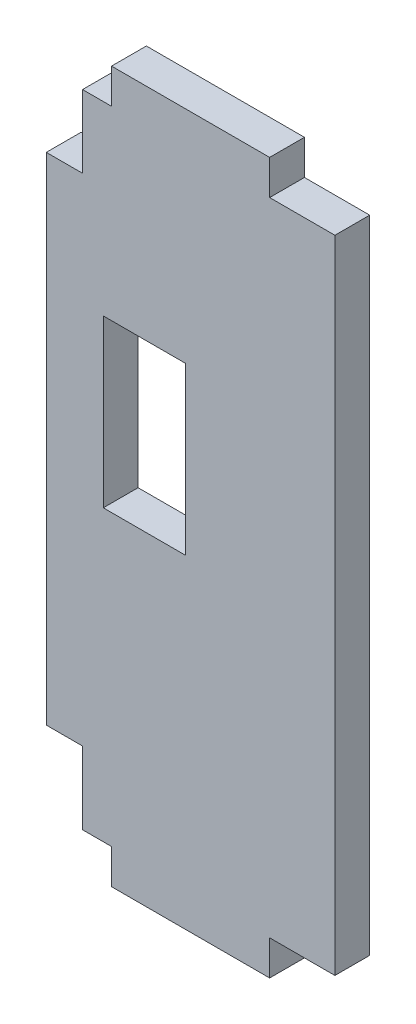
ISO-10303-21;
HEADER;
FILE_DESCRIPTION(('STEP AP214'),'2;1');
FILE_NAME('part.step','',(''),(''),'','','');
FILE_SCHEMA(('AUTOMOTIVE_DESIGN { 1 0 10303 214 1 1 1 1 }'));
ENDSEC;
DATA;
#1=APPLICATION_CONTEXT('core data for automotive mechanical design processes');
#2=APPLICATION_PROTOCOL_DEFINITION('international standard','automotive_design',2000,#1);
#3=PRODUCT_CONTEXT('',#1,'mechanical');
#4=PRODUCT('Part','Part','',(#3));
#5=PRODUCT_RELATED_PRODUCT_CATEGORY('part','',(#4));
#6=PRODUCT_DEFINITION_FORMATION('','',#4);
#7=PRODUCT_DEFINITION_CONTEXT('part definition',#1,'design');
#8=PRODUCT_DEFINITION('design','',#6,#7);
#9=PRODUCT_DEFINITION_SHAPE('','',#8);
#10=(LENGTH_UNIT() NAMED_UNIT(*) SI_UNIT(.MILLI.,.METRE.));
#11=(NAMED_UNIT(*) PLANE_ANGLE_UNIT() SI_UNIT($,.RADIAN.));
#12=(NAMED_UNIT(*) SI_UNIT($,.STERADIAN.) SOLID_ANGLE_UNIT());
#13=UNCERTAINTY_MEASURE_WITH_UNIT(LENGTH_MEASURE(1.E-05),#10,'distance_accuracy_value','');
#14=(GEOMETRIC_REPRESENTATION_CONTEXT(3) GLOBAL_UNCERTAINTY_ASSIGNED_CONTEXT((#13)) GLOBAL_UNIT_ASSIGNED_CONTEXT((#10,
#11,#12)) REPRESENTATION_CONTEXT('',''));
#15=CARTESIAN_POINT('',(0.,0.,0.));
#16=DIRECTION('',(0.,0.,1.));
#17=DIRECTION('',(1.,0.,0.));
#18=AXIS2_PLACEMENT_3D('',#15,#16,#17);
#19=CARTESIAN_POINT('',(0.,0.,3.048));
#20=DIRECTION('',(0.,0.,1.));
#21=DIRECTION('',(1.,0.,0.));
#22=AXIS2_PLACEMENT_3D('',#19,#20,#21);
#23=PLANE('',#22);
#24=DIRECTION('',(-1.,0.,0.));
#25=VECTOR('',#24,1.);
#26=CARTESIAN_POINT('',(-17.3482,-0.558799999999996,3.048));
#27=LINE('',#26,#25);
#28=CARTESIAN_POINT('',(-14.8082,-0.558799999999996,3.048));
#29=VERTEX_POINT('',#28);
#30=CARTESIAN_POINT('',(-17.3482,-0.558799999999996,3.048));
#31=VERTEX_POINT('',#30);
#32=EDGE_CURVE('E206',#29,#31,#27,.T.);
#33=ORIENTED_EDGE('',*,*,#32,.T.);
#34=DIRECTION('',(0.,-1.,0.));
#35=VECTOR('',#34,1.);
#36=CARTESIAN_POINT('',(-17.3482,-0.558799999999996,3.048));
#37=LINE('',#36,#35);
#38=CARTESIAN_POINT('',(-17.3482,-6.9088,3.048));
#39=VERTEX_POINT('',#38);
#40=EDGE_CURVE('E209',#31,#39,#37,.T.);
#41=ORIENTED_EDGE('',*,*,#40,.T.);
#42=DIRECTION('',(-1.,0.,0.));
#43=VECTOR('',#42,1.);
#44=CARTESIAN_POINT('',(-17.3482,-6.9088,3.048));
#45=LINE('',#44,#43);
#46=CARTESIAN_POINT('',(-20.5232,-6.9088,3.048));
#47=VERTEX_POINT('',#46);
#48=EDGE_CURVE('E212',#39,#47,#45,.T.);
#49=ORIENTED_EDGE('',*,*,#48,.T.);
#50=DIRECTION('',(0.,-1.,0.));
#51=VECTOR('',#50,1.);
#52=CARTESIAN_POINT('',(-20.5232,-6.9088,3.048));
#53=LINE('',#52,#51);
#54=CARTESIAN_POINT('',(-20.5232,-50.3428,3.048));
#55=VERTEX_POINT('',#54);
#56=EDGE_CURVE('E214',#47,#55,#53,.T.);
#57=ORIENTED_EDGE('',*,*,#56,.T.);
#58=DIRECTION('',(1.,0.,0.));
#59=VECTOR('',#58,1.);
#60=CARTESIAN_POINT('',(-20.5232,-50.3428,3.048));
#61=LINE('',#60,#59);
#62=CARTESIAN_POINT('',(-17.3482,-50.3428,3.048));
#63=VERTEX_POINT('',#62);
#64=EDGE_CURVE('E216',#55,#63,#61,.T.);
#65=ORIENTED_EDGE('',*,*,#64,.T.);
#66=DIRECTION('',(0.,-1.,0.));
#67=VECTOR('',#66,1.);
#68=CARTESIAN_POINT('',(-17.3482,-50.3428,3.048));
#69=LINE('',#68,#67);
#70=CARTESIAN_POINT('',(-17.3482,-56.6928,3.048));
#71=VERTEX_POINT('',#70);
#72=EDGE_CURVE('E218',#63,#71,#69,.T.);
#73=ORIENTED_EDGE('',*,*,#72,.T.);
#74=DIRECTION('',(1.,0.,0.));
#75=VECTOR('',#74,1.);
#76=CARTESIAN_POINT('',(-14.8082,-56.6928,3.048));
#77=LINE('',#76,#75);
#78=CARTESIAN_POINT('',(-14.8082,-56.6928,3.048));
#79=VERTEX_POINT('',#78);
#80=EDGE_CURVE('E220',#71,#79,#77,.T.);
#81=ORIENTED_EDGE('',*,*,#80,.T.);
#82=DIRECTION('',(0.,-1.,0.));
#83=VECTOR('',#82,1.);
#84=CARTESIAN_POINT('',(-14.8082,-59.7408,3.048));
#85=LINE('',#84,#83);
#86=CARTESIAN_POINT('',(-14.8082,-59.7408,3.048));
#87=VERTEX_POINT('',#86);
#88=EDGE_CURVE('E222',#79,#87,#85,.T.);
#89=ORIENTED_EDGE('',*,*,#88,.T.);
#90=DIRECTION('',(1.,0.,0.));
#91=VECTOR('',#90,1.);
#92=CARTESIAN_POINT('',(-0.965199999999926,-59.7408,3.048));
#93=LINE('',#92,#91);
#94=CARTESIAN_POINT('',(-0.965199999999926,-59.7408,3.048));
#95=VERTEX_POINT('',#94);
#96=EDGE_CURVE('E224',#87,#95,#93,.T.);
#97=ORIENTED_EDGE('',*,*,#96,.T.);
#98=DIRECTION('',(0.,1.,0.));
#99=VECTOR('',#98,1.);
#100=CARTESIAN_POINT('',(-0.965199999999925,-56.6928,3.048));
#101=LINE('',#100,#99);
#102=CARTESIAN_POINT('',(-0.965199999999925,-56.6928,3.048));
#103=VERTEX_POINT('',#102);
#104=EDGE_CURVE('E226',#95,#103,#101,.T.);
#105=ORIENTED_EDGE('',*,*,#104,.T.);
#106=DIRECTION('',(1.,0.,0.));
#107=VECTOR('',#106,1.);
#108=CARTESIAN_POINT('',(4.74980000000007,-56.6928,3.048));
#109=LINE('',#108,#107);
#110=CARTESIAN_POINT('',(4.74980000000007,-56.6928,3.048));
#111=VERTEX_POINT('',#110);
#112=EDGE_CURVE('E228',#103,#111,#109,.T.);
#113=ORIENTED_EDGE('',*,*,#112,.T.);
#114=DIRECTION('',(0.,1.,0.));
#115=VECTOR('',#114,1.);
#116=CARTESIAN_POINT('',(4.74980000000007,-0.558800000000003,3.048));
#117=LINE('',#116,#115);
#118=CARTESIAN_POINT('',(4.74980000000007,-0.558800000000003,3.048));
#119=VERTEX_POINT('',#118);
#120=EDGE_CURVE('E230',#111,#119,#117,.T.);
#121=ORIENTED_EDGE('',*,*,#120,.T.);
#122=DIRECTION('',(-1.,0.,0.));
#123=VECTOR('',#122,1.);
#124=CARTESIAN_POINT('',(-0.965199999999925,-0.558800000000003,3.048));
#125=LINE('',#124,#123);
#126=CARTESIAN_POINT('',(-0.965199999999925,-0.558800000000003,3.048));
#127=VERTEX_POINT('',#126);
#128=EDGE_CURVE('E232',#119,#127,#125,.T.);
#129=ORIENTED_EDGE('',*,*,#128,.T.);
#130=DIRECTION('',(0.,1.,0.));
#131=VECTOR('',#130,1.);
#132=CARTESIAN_POINT('',(-0.965199999999925,2.4892,3.048));
#133=LINE('',#132,#131);
#134=CARTESIAN_POINT('',(-0.965199999999925,2.4892,3.048));
#135=VERTEX_POINT('',#134);
#136=EDGE_CURVE('E234',#127,#135,#133,.T.);
#137=ORIENTED_EDGE('',*,*,#136,.T.);
#138=DIRECTION('',(-1.,0.,0.));
#139=VECTOR('',#138,1.);
#140=CARTESIAN_POINT('',(-14.8082,2.4892,3.048));
#141=LINE('',#140,#139);
#142=CARTESIAN_POINT('',(-14.8082,2.4892,3.048));
#143=VERTEX_POINT('',#142);
#144=EDGE_CURVE('E236',#135,#143,#141,.T.);
#145=ORIENTED_EDGE('',*,*,#144,.T.);
#146=DIRECTION('',(0.,-1.,0.));
#147=VECTOR('',#146,1.);
#148=CARTESIAN_POINT('',(-14.8082,-0.558799999999996,3.048));
#149=LINE('',#148,#147);
#150=EDGE_CURVE('E238',#143,#29,#149,.T.);
#151=ORIENTED_EDGE('',*,*,#150,.T.);
#152=EDGE_LOOP('',(#33,#41,#49,#57,#65,#73,#81,#89,#97,#105,#113,#121,#129,#137,#145,#151));
#153=FACE_BOUND('',#152,.T.);
#154=DIRECTION('',(1.,0.,0.));
#155=VECTOR('',#154,1.);
#156=CARTESIAN_POINT('',(-15.5321,-31.369,3.048));
#157=LINE('',#156,#155);
#158=CARTESIAN_POINT('',(-15.5321,-31.369,3.048));
#159=VERTEX_POINT('',#158);
#160=CARTESIAN_POINT('',(-8.34390000000002,-31.369,3.048));
#161=VERTEX_POINT('',#160);
#162=EDGE_CURVE('E178',#159,#161,#157,.T.);
#163=ORIENTED_EDGE('',*,*,#162,.F.);
#164=DIRECTION('',(0.,-1.,0.));
#165=VECTOR('',#164,1.);
#166=CARTESIAN_POINT('',(-15.5321,-16.8148,3.048));
#167=LINE('',#166,#165);
#168=CARTESIAN_POINT('',(-15.5321,-16.8148,3.048));
#169=VERTEX_POINT('',#168);
#170=EDGE_CURVE('E170',#169,#159,#167,.T.);
#171=ORIENTED_EDGE('',*,*,#170,.F.);
#172=DIRECTION('',(-1.,0.,0.));
#173=VECTOR('',#172,1.);
#174=CARTESIAN_POINT('',(-15.5321,-16.8148,3.048));
#175=LINE('',#174,#173);
#176=CARTESIAN_POINT('',(-8.34390000000002,-16.8148,3.048));
#177=VERTEX_POINT('',#176);
#178=EDGE_CURVE('E192',#177,#169,#175,.T.);
#179=ORIENTED_EDGE('',*,*,#178,.F.);
#180=DIRECTION('',(0.,1.,0.));
#181=VECTOR('',#180,1.);
#182=CARTESIAN_POINT('',(-8.34390000000002,-16.8148,3.048));
#183=LINE('',#182,#181);
#184=EDGE_CURVE('E190',#161,#177,#183,.T.);
#185=ORIENTED_EDGE('',*,*,#184,.F.);
#186=EDGE_LOOP('',(#163,#171,#179,#185));
#187=FACE_BOUND('',#186,.T.);
#188=ADVANCED_FACE('F33',(#153,#187),#23,.T.);
#189=CARTESIAN_POINT('',(0.,0.,0.));
#190=DIRECTION('',(0.,0.,1.));
#191=DIRECTION('',(1.,0.,0.));
#192=AXIS2_PLACEMENT_3D('',#189,#190,#191);
#193=PLANE('',#192);
#194=DIRECTION('',(-1.,0.,0.));
#195=VECTOR('',#194,1.);
#196=CARTESIAN_POINT('',(-17.3482,-0.558799999999996,0.));
#197=LINE('',#196,#195);
#198=CARTESIAN_POINT('',(-14.8082,-0.558799999999996,0.));
#199=VERTEX_POINT('',#198);
#200=CARTESIAN_POINT('',(-17.3482,-0.558799999999996,0.));
#201=VERTEX_POINT('',#200);
#202=EDGE_CURVE('E186',#199,#201,#197,.T.);
#203=ORIENTED_EDGE('',*,*,#202,.F.);
#204=DIRECTION('',(0.,-1.,0.));
#205=VECTOR('',#204,1.);
#206=CARTESIAN_POINT('',(-14.8082,-0.558799999999996,0.));
#207=LINE('',#206,#205);
#208=CARTESIAN_POINT('',(-14.8082,2.4892,0.));
#209=VERTEX_POINT('',#208);
#210=EDGE_CURVE('E210',#209,#199,#207,.T.);
#211=ORIENTED_EDGE('',*,*,#210,.F.);
#212=DIRECTION('',(-1.,0.,0.));
#213=VECTOR('',#212,1.);
#214=CARTESIAN_POINT('',(-14.8082,2.4892,0.));
#215=LINE('',#214,#213);
#216=CARTESIAN_POINT('',(-0.965199999999925,2.4892,0.));
#217=VERTEX_POINT('',#216);
#218=EDGE_CURVE('E269',#217,#209,#215,.T.);
#219=ORIENTED_EDGE('',*,*,#218,.F.);
#220=DIRECTION('',(0.,1.,0.));
#221=VECTOR('',#220,1.);
#222=CARTESIAN_POINT('',(-0.965199999999925,2.4892,0.));
#223=LINE('',#222,#221);
#224=CARTESIAN_POINT('',(-0.965199999999925,-0.558800000000003,0.));
#225=VERTEX_POINT('',#224);
#226=EDGE_CURVE('E267',#225,#217,#223,.T.);
#227=ORIENTED_EDGE('',*,*,#226,.F.);
#228=DIRECTION('',(-1.,0.,0.));
#229=VECTOR('',#228,1.);
#230=CARTESIAN_POINT('',(-0.965199999999925,-0.558800000000003,0.));
#231=LINE('',#230,#229);
#232=CARTESIAN_POINT('',(4.74980000000007,-0.558800000000003,0.));
#233=VERTEX_POINT('',#232);
#234=EDGE_CURVE('E265',#233,#225,#231,.T.);
#235=ORIENTED_EDGE('',*,*,#234,.F.);
#236=DIRECTION('',(0.,1.,0.));
#237=VECTOR('',#236,1.);
#238=CARTESIAN_POINT('',(4.74980000000007,-0.558800000000003,0.));
#239=LINE('',#238,#237);
#240=CARTESIAN_POINT('',(4.74980000000007,-56.6928,0.));
#241=VERTEX_POINT('',#240);
#242=EDGE_CURVE('E263',#241,#233,#239,.T.);
#243=ORIENTED_EDGE('',*,*,#242,.F.);
#244=DIRECTION('',(1.,0.,0.));
#245=VECTOR('',#244,1.);
#246=CARTESIAN_POINT('',(4.74980000000007,-56.6928,0.));
#247=LINE('',#246,#245);
#248=CARTESIAN_POINT('',(-0.965199999999925,-56.6928,0.));
#249=VERTEX_POINT('',#248);
#250=EDGE_CURVE('E261',#249,#241,#247,.T.);
#251=ORIENTED_EDGE('',*,*,#250,.F.);
#252=DIRECTION('',(0.,1.,0.));
#253=VECTOR('',#252,1.);
#254=CARTESIAN_POINT('',(-0.965199999999925,-56.6928,0.));
#255=LINE('',#254,#253);
#256=CARTESIAN_POINT('',(-0.965199999999926,-59.7408,0.));
#257=VERTEX_POINT('',#256);
#258=EDGE_CURVE('E259',#257,#249,#255,.T.);
#259=ORIENTED_EDGE('',*,*,#258,.F.);
#260=DIRECTION('',(1.,0.,0.));
#261=VECTOR('',#260,1.);
#262=CARTESIAN_POINT('',(-0.965199999999926,-59.7408,0.));
#263=LINE('',#262,#261);
#264=CARTESIAN_POINT('',(-14.8082,-59.7408,0.));
#265=VERTEX_POINT('',#264);
#266=EDGE_CURVE('E257',#265,#257,#263,.T.);
#267=ORIENTED_EDGE('',*,*,#266,.F.);
#268=DIRECTION('',(0.,-1.,0.));
#269=VECTOR('',#268,1.);
#270=CARTESIAN_POINT('',(-14.8082,-59.7408,0.));
#271=LINE('',#270,#269);
#272=CARTESIAN_POINT('',(-14.8082,-56.6928,0.));
#273=VERTEX_POINT('',#272);
#274=EDGE_CURVE('E255',#273,#265,#271,.T.);
#275=ORIENTED_EDGE('',*,*,#274,.F.);
#276=DIRECTION('',(1.,0.,0.));
#277=VECTOR('',#276,1.);
#278=CARTESIAN_POINT('',(-14.8082,-56.6928,0.));
#279=LINE('',#278,#277);
#280=CARTESIAN_POINT('',(-17.3482,-56.6928,0.));
#281=VERTEX_POINT('',#280);
#282=EDGE_CURVE('E253',#281,#273,#279,.T.);
#283=ORIENTED_EDGE('',*,*,#282,.F.);
#284=DIRECTION('',(0.,-1.,0.));
#285=VECTOR('',#284,1.);
#286=CARTESIAN_POINT('',(-17.3482,-50.3428,0.));
#287=LINE('',#286,#285);
#288=CARTESIAN_POINT('',(-17.3482,-50.3428,0.));
#289=VERTEX_POINT('',#288);
#290=EDGE_CURVE('E251',#289,#281,#287,.T.);
#291=ORIENTED_EDGE('',*,*,#290,.F.);
#292=DIRECTION('',(1.,0.,0.));
#293=VECTOR('',#292,1.);
#294=CARTESIAN_POINT('',(-20.5232,-50.3428,0.));
#295=LINE('',#294,#293);
#296=CARTESIAN_POINT('',(-20.5232,-50.3428,0.));
#297=VERTEX_POINT('',#296);
#298=EDGE_CURVE('E249',#297,#289,#295,.T.);
#299=ORIENTED_EDGE('',*,*,#298,.F.);
#300=DIRECTION('',(0.,-1.,0.));
#301=VECTOR('',#300,1.);
#302=CARTESIAN_POINT('',(-20.5232,-6.9088,0.));
#303=LINE('',#302,#301);
#304=CARTESIAN_POINT('',(-20.5232,-6.9088,0.));
#305=VERTEX_POINT('',#304);
#306=EDGE_CURVE('E247',#305,#297,#303,.T.);
#307=ORIENTED_EDGE('',*,*,#306,.F.);
#308=DIRECTION('',(-1.,0.,0.));
#309=VECTOR('',#308,1.);
#310=CARTESIAN_POINT('',(-17.3482,-6.9088,0.));
#311=LINE('',#310,#309);
#312=CARTESIAN_POINT('',(-17.3482,-6.9088,0.));
#313=VERTEX_POINT('',#312);
#314=EDGE_CURVE('E245',#313,#305,#311,.T.);
#315=ORIENTED_EDGE('',*,*,#314,.F.);
#316=DIRECTION('',(0.,-1.,0.));
#317=VECTOR('',#316,1.);
#318=CARTESIAN_POINT('',(-17.3482,-0.558799999999996,0.));
#319=LINE('',#318,#317);
#320=EDGE_CURVE('E243',#201,#313,#319,.T.);
#321=ORIENTED_EDGE('',*,*,#320,.F.);
#322=EDGE_LOOP('',(#203,#211,#219,#227,#235,#243,#251,#259,#267,#275,#283,#291,#299,#307,#315,#321));
#323=FACE_BOUND('',#322,.T.);
#324=DIRECTION('',(0.,-1.,0.));
#325=VECTOR('',#324,1.);
#326=CARTESIAN_POINT('',(-15.5321,-16.8148,0.));
#327=LINE('',#326,#325);
#328=CARTESIAN_POINT('',(-15.5321,-16.8148,0.));
#329=VERTEX_POINT('',#328);
#330=CARTESIAN_POINT('',(-15.5321,-31.369,0.));
#331=VERTEX_POINT('',#330);
#332=EDGE_CURVE('E56',#329,#331,#327,.T.);
#333=ORIENTED_EDGE('',*,*,#332,.T.);
#334=DIRECTION('',(1.,0.,0.));
#335=VECTOR('',#334,1.);
#336=CARTESIAN_POINT('',(-15.5321,-31.369,0.));
#337=LINE('',#336,#335);
#338=CARTESIAN_POINT('',(-8.34390000000002,-31.369,0.));
#339=VERTEX_POINT('',#338);
#340=EDGE_CURVE('E185',#331,#339,#337,.T.);
#341=ORIENTED_EDGE('',*,*,#340,.T.);
#342=DIRECTION('',(0.,1.,0.));
#343=VECTOR('',#342,1.);
#344=CARTESIAN_POINT('',(-8.34390000000002,-16.8148,0.));
#345=LINE('',#344,#343);
#346=CARTESIAN_POINT('',(-8.34390000000002,-16.8148,0.));
#347=VERTEX_POINT('',#346);
#348=EDGE_CURVE('E198',#339,#347,#345,.T.);
#349=ORIENTED_EDGE('',*,*,#348,.T.);
#350=DIRECTION('',(-1.,0.,0.));
#351=VECTOR('',#350,1.);
#352=CARTESIAN_POINT('',(-15.5321,-16.8148,0.));
#353=LINE('',#352,#351);
#354=EDGE_CURVE('E179',#347,#329,#353,.T.);
#355=ORIENTED_EDGE('',*,*,#354,.T.);
#356=EDGE_LOOP('',(#333,#341,#349,#355));
#357=FACE_BOUND('',#356,.T.);
#358=ADVANCED_FACE('F323',(#323,#357),#193,.F.);
#359=CARTESIAN_POINT('',(-17.3482,-0.558799999999996,3.048));
#360=DIRECTION('',(0.,-1.,0.));
#361=DIRECTION('',(1.,0.,0.));
#362=AXIS2_PLACEMENT_3D('',#359,#360,#361);
#363=PLANE('',#362);
#364=ORIENTED_EDGE('',*,*,#202,.T.);
#365=DIRECTION('',(0.,0.,-1.));
#366=VECTOR('',#365,1.);
#367=CARTESIAN_POINT('',(-17.3482,-0.558799999999996,3.048));
#368=LINE('',#367,#366);
#369=EDGE_CURVE('E11',#31,#201,#368,.T.);
#370=ORIENTED_EDGE('',*,*,#369,.F.);
#371=ORIENTED_EDGE('',*,*,#32,.F.);
#372=DIRECTION('',(0.,0.,-1.));
#373=VECTOR('',#372,1.);
#374=CARTESIAN_POINT('',(-14.8082,-0.558799999999996,3.048));
#375=LINE('',#374,#373);
#376=EDGE_CURVE('E240',#29,#199,#375,.T.);
#377=ORIENTED_EDGE('',*,*,#376,.T.);
#378=EDGE_LOOP('',(#364,#370,#371,#377));
#379=FACE_BOUND('',#378,.T.);
#380=ADVANCED_FACE('F35',(#379),#363,.F.);
#381=CARTESIAN_POINT('',(-17.3482,-0.558799999999996,3.048));
#382=DIRECTION('',(1.,0.,0.));
#383=DIRECTION('',(0.,1.,0.));
#384=AXIS2_PLACEMENT_3D('',#381,#382,#383);
#385=PLANE('',#384);
#386=ORIENTED_EDGE('',*,*,#320,.T.);
#387=DIRECTION('',(0.,0.,-1.));
#388=VECTOR('',#387,1.);
#389=CARTESIAN_POINT('',(-17.3482,-6.9088,3.048));
#390=LINE('',#389,#388);
#391=EDGE_CURVE('E41',#39,#313,#390,.T.);
#392=ORIENTED_EDGE('',*,*,#391,.F.);
#393=ORIENTED_EDGE('',*,*,#40,.F.);
#394=ORIENTED_EDGE('',*,*,#369,.T.);
#395=EDGE_LOOP('',(#386,#392,#393,#394));
#396=FACE_BOUND('',#395,.T.);
#397=ADVANCED_FACE('F340',(#396),#385,.F.);
#398=CARTESIAN_POINT('',(-17.3482,-6.9088,3.048));
#399=DIRECTION('',(0.,-1.,0.));
#400=DIRECTION('',(0.,0.,-1.));
#401=AXIS2_PLACEMENT_3D('',#398,#399,#400);
#402=PLANE('',#401);
#403=ORIENTED_EDGE('',*,*,#314,.T.);
#404=DIRECTION('',(0.,0.,-1.));
#405=VECTOR('',#404,1.);
#406=CARTESIAN_POINT('',(-20.5232,-6.9088,3.048));
#407=LINE('',#406,#405);
#408=EDGE_CURVE('E310',#47,#305,#407,.T.);
#409=ORIENTED_EDGE('',*,*,#408,.F.);
#410=ORIENTED_EDGE('',*,*,#48,.F.);
#411=ORIENTED_EDGE('',*,*,#391,.T.);
#412=EDGE_LOOP('',(#403,#409,#410,#411));
#413=FACE_BOUND('',#412,.T.);
#414=ADVANCED_FACE('F317',(#413),#402,.F.);
#415=CARTESIAN_POINT('',(-20.5232,-6.9088,3.048));
#416=DIRECTION('',(1.,0.,0.));
#417=DIRECTION('',(0.,1.,0.));
#418=AXIS2_PLACEMENT_3D('',#415,#416,#417);
#419=PLANE('',#418);
#420=ORIENTED_EDGE('',*,*,#306,.T.);
#421=DIRECTION('',(0.,0.,-1.));
#422=VECTOR('',#421,1.);
#423=CARTESIAN_POINT('',(-20.5232,-50.3428,3.048));
#424=LINE('',#423,#422);
#425=EDGE_CURVE('E307',#55,#297,#424,.T.);
#426=ORIENTED_EDGE('',*,*,#425,.F.);
#427=ORIENTED_EDGE('',*,*,#56,.F.);
#428=ORIENTED_EDGE('',*,*,#408,.T.);
#429=EDGE_LOOP('',(#420,#426,#427,#428));
#430=FACE_BOUND('',#429,.T.);
#431=ADVANCED_FACE('F329',(#430),#419,.F.);
#432=CARTESIAN_POINT('',(-20.5232,-50.3428,3.048));
#433=DIRECTION('',(0.,1.,0.));
#434=DIRECTION('',(0.,0.,1.));
#435=AXIS2_PLACEMENT_3D('',#432,#433,#434);
#436=PLANE('',#435);
#437=ORIENTED_EDGE('',*,*,#298,.T.);
#438=DIRECTION('',(0.,0.,-1.));
#439=VECTOR('',#438,1.);
#440=CARTESIAN_POINT('',(-17.3482,-50.3428,3.048));
#441=LINE('',#440,#439);
#442=EDGE_CURVE('E304',#63,#289,#441,.T.);
#443=ORIENTED_EDGE('',*,*,#442,.F.);
#444=ORIENTED_EDGE('',*,*,#64,.F.);
#445=ORIENTED_EDGE('',*,*,#425,.T.);
#446=EDGE_LOOP('',(#437,#443,#444,#445));
#447=FACE_BOUND('',#446,.T.);
#448=ADVANCED_FACE('F333',(#447),#436,.F.);
#449=CARTESIAN_POINT('',(-17.3482,-50.3428,3.048));
#450=DIRECTION('',(1.,0.,0.));
#451=DIRECTION('',(0.,1.,0.));
#452=AXIS2_PLACEMENT_3D('',#449,#450,#451);
#453=PLANE('',#452);
#454=ORIENTED_EDGE('',*,*,#290,.T.);
#455=DIRECTION('',(0.,0.,-1.));
#456=VECTOR('',#455,1.);
#457=CARTESIAN_POINT('',(-17.3482,-56.6928,3.048));
#458=LINE('',#457,#456);
#459=EDGE_CURVE('E301',#71,#281,#458,.T.);
#460=ORIENTED_EDGE('',*,*,#459,.F.);
#461=ORIENTED_EDGE('',*,*,#72,.F.);
#462=ORIENTED_EDGE('',*,*,#442,.T.);
#463=EDGE_LOOP('',(#454,#460,#461,#462));
#464=FACE_BOUND('',#463,.T.);
#465=ADVANCED_FACE('F393',(#464),#453,.F.);
#466=CARTESIAN_POINT('',(-14.8082,-56.6928,3.048));
#467=DIRECTION('',(0.,1.,0.));
#468=DIRECTION('',(-1.,0.,0.));
#469=AXIS2_PLACEMENT_3D('',#466,#467,#468);
#470=PLANE('',#469);
#471=ORIENTED_EDGE('',*,*,#282,.T.);
#472=DIRECTION('',(0.,0.,-1.));
#473=VECTOR('',#472,1.);
#474=CARTESIAN_POINT('',(-14.8082,-56.6928,3.048));
#475=LINE('',#474,#473);
#476=EDGE_CURVE('E298',#79,#273,#475,.T.);
#477=ORIENTED_EDGE('',*,*,#476,.F.);
#478=ORIENTED_EDGE('',*,*,#80,.F.);
#479=ORIENTED_EDGE('',*,*,#459,.T.);
#480=EDGE_LOOP('',(#471,#477,#478,#479));
#481=FACE_BOUND('',#480,.T.);
#482=ADVANCED_FACE('F390',(#481),#470,.F.);
#483=CARTESIAN_POINT('',(-14.8082,-59.7408,3.048));
#484=DIRECTION('',(1.,0.,0.));
#485=DIRECTION('',(0.,0.,-1.));
#486=AXIS2_PLACEMENT_3D('',#483,#484,#485);
#487=PLANE('',#486);
#488=ORIENTED_EDGE('',*,*,#274,.T.);
#489=DIRECTION('',(0.,0.,-1.));
#490=VECTOR('',#489,1.);
#491=CARTESIAN_POINT('',(-14.8082,-59.7408,3.048));
#492=LINE('',#491,#490);
#493=EDGE_CURVE('E295',#87,#265,#492,.T.);
#494=ORIENTED_EDGE('',*,*,#493,.F.);
#495=ORIENTED_EDGE('',*,*,#88,.F.);
#496=ORIENTED_EDGE('',*,*,#476,.T.);
#497=EDGE_LOOP('',(#488,#494,#495,#496));
#498=FACE_BOUND('',#497,.T.);
#499=ADVANCED_FACE('F386',(#498),#487,.F.);
#500=CARTESIAN_POINT('',(-0.965199999999926,-59.7408,3.048));
#501=DIRECTION('',(0.,1.,0.));
#502=DIRECTION('',(0.,0.,1.));
#503=AXIS2_PLACEMENT_3D('',#500,#501,#502);
#504=PLANE('',#503);
#505=ORIENTED_EDGE('',*,*,#266,.T.);
#506=DIRECTION('',(0.,0.,-1.));
#507=VECTOR('',#506,1.);
#508=CARTESIAN_POINT('',(-0.965199999999926,-59.7408,3.048));
#509=LINE('',#508,#507);
#510=EDGE_CURVE('E292',#95,#257,#509,.T.);
#511=ORIENTED_EDGE('',*,*,#510,.F.);
#512=ORIENTED_EDGE('',*,*,#96,.F.);
#513=ORIENTED_EDGE('',*,*,#493,.T.);
#514=EDGE_LOOP('',(#505,#511,#512,#513));
#515=FACE_BOUND('',#514,.T.);
#516=ADVANCED_FACE('F382',(#515),#504,.F.);
#517=CARTESIAN_POINT('',(-0.965199999999925,-56.6928,3.048));
#518=DIRECTION('',(-1.,0.,0.));
#519=DIRECTION('',(0.,-1.,0.));
#520=AXIS2_PLACEMENT_3D('',#517,#518,#519);
#521=PLANE('',#520);
#522=ORIENTED_EDGE('',*,*,#258,.T.);
#523=DIRECTION('',(0.,0.,-1.));
#524=VECTOR('',#523,1.);
#525=CARTESIAN_POINT('',(-0.965199999999925,-56.6928,3.048));
#526=LINE('',#525,#524);
#527=EDGE_CURVE('E289',#103,#249,#526,.T.);
#528=ORIENTED_EDGE('',*,*,#527,.F.);
#529=ORIENTED_EDGE('',*,*,#104,.F.);
#530=ORIENTED_EDGE('',*,*,#510,.T.);
#531=EDGE_LOOP('',(#522,#528,#529,#530));
#532=FACE_BOUND('',#531,.T.);
#533=ADVANCED_FACE('F377',(#532),#521,.F.);
#534=CARTESIAN_POINT('',(4.74980000000007,-56.6928,3.048));
#535=DIRECTION('',(0.,1.,0.));
#536=DIRECTION('',(0.,0.,1.));
#537=AXIS2_PLACEMENT_3D('',#534,#535,#536);
#538=PLANE('',#537);
#539=ORIENTED_EDGE('',*,*,#250,.T.);
#540=DIRECTION('',(0.,0.,-1.));
#541=VECTOR('',#540,1.);
#542=CARTESIAN_POINT('',(4.74980000000007,-56.6928,3.048));
#543=LINE('',#542,#541);
#544=EDGE_CURVE('E286',#111,#241,#543,.T.);
#545=ORIENTED_EDGE('',*,*,#544,.F.);
#546=ORIENTED_EDGE('',*,*,#112,.F.);
#547=ORIENTED_EDGE('',*,*,#527,.T.);
#548=EDGE_LOOP('',(#539,#545,#546,#547));
#549=FACE_BOUND('',#548,.T.);
#550=ADVANCED_FACE('F371',(#549),#538,.F.);
#551=CARTESIAN_POINT('',(4.74980000000007,-0.558800000000003,3.048));
#552=DIRECTION('',(-1.,0.,0.));
#553=DIRECTION('',(0.,0.,1.));
#554=AXIS2_PLACEMENT_3D('',#551,#552,#553);
#555=PLANE('',#554);
#556=ORIENTED_EDGE('',*,*,#242,.T.);
#557=DIRECTION('',(0.,0.,-1.));
#558=VECTOR('',#557,1.);
#559=CARTESIAN_POINT('',(4.74980000000007,-0.558800000000003,3.048));
#560=LINE('',#559,#558);
#561=EDGE_CURVE('E283',#119,#233,#560,.T.);
#562=ORIENTED_EDGE('',*,*,#561,.F.);
#563=ORIENTED_EDGE('',*,*,#120,.F.);
#564=ORIENTED_EDGE('',*,*,#544,.T.);
#565=EDGE_LOOP('',(#556,#562,#563,#564));
#566=FACE_BOUND('',#565,.T.);
#567=ADVANCED_FACE('F367',(#566),#555,.F.);
#568=CARTESIAN_POINT('',(-0.965199999999925,-0.558800000000003,3.048));
#569=DIRECTION('',(0.,-1.,0.));
#570=DIRECTION('',(0.,0.,-1.));
#571=AXIS2_PLACEMENT_3D('',#568,#569,#570);
#572=PLANE('',#571);
#573=ORIENTED_EDGE('',*,*,#234,.T.);
#574=DIRECTION('',(0.,0.,-1.));
#575=VECTOR('',#574,1.);
#576=CARTESIAN_POINT('',(-0.965199999999925,-0.558800000000003,3.048));
#577=LINE('',#576,#575);
#578=EDGE_CURVE('E280',#127,#225,#577,.T.);
#579=ORIENTED_EDGE('',*,*,#578,.F.);
#580=ORIENTED_EDGE('',*,*,#128,.F.);
#581=ORIENTED_EDGE('',*,*,#561,.T.);
#582=EDGE_LOOP('',(#573,#579,#580,#581));
#583=FACE_BOUND('',#582,.T.);
#584=ADVANCED_FACE('F362',(#583),#572,.F.);
#585=CARTESIAN_POINT('',(-0.965199999999925,2.4892,3.048));
#586=DIRECTION('',(-1.,0.,0.));
#587=DIRECTION('',(0.,0.,1.));
#588=AXIS2_PLACEMENT_3D('',#585,#586,#587);
#589=PLANE('',#588);
#590=ORIENTED_EDGE('',*,*,#226,.T.);
#591=DIRECTION('',(0.,0.,-1.));
#592=VECTOR('',#591,1.);
#593=CARTESIAN_POINT('',(-0.965199999999925,2.4892,3.048));
#594=LINE('',#593,#592);
#595=EDGE_CURVE('E277',#135,#217,#594,.T.);
#596=ORIENTED_EDGE('',*,*,#595,.F.);
#597=ORIENTED_EDGE('',*,*,#136,.F.);
#598=ORIENTED_EDGE('',*,*,#578,.T.);
#599=EDGE_LOOP('',(#590,#596,#597,#598));
#600=FACE_BOUND('',#599,.T.);
#601=ADVANCED_FACE('F356',(#600),#589,.F.);
#602=CARTESIAN_POINT('',(-14.8082,2.4892,3.048));
#603=DIRECTION('',(0.,-1.,0.));
#604=DIRECTION('',(1.,0.,0.));
#605=AXIS2_PLACEMENT_3D('',#602,#603,#604);
#606=PLANE('',#605);
#607=ORIENTED_EDGE('',*,*,#218,.T.);
#608=DIRECTION('',(0.,0.,-1.));
#609=VECTOR('',#608,1.);
#610=CARTESIAN_POINT('',(-14.8082,2.4892,3.048));
#611=LINE('',#610,#609);
#612=EDGE_CURVE('E274',#143,#209,#611,.T.);
#613=ORIENTED_EDGE('',*,*,#612,.F.);
#614=ORIENTED_EDGE('',*,*,#144,.F.);
#615=ORIENTED_EDGE('',*,*,#595,.T.);
#616=EDGE_LOOP('',(#607,#613,#614,#615));
#617=FACE_BOUND('',#616,.T.);
#618=ADVANCED_FACE('F352',(#617),#606,.F.);
#619=CARTESIAN_POINT('',(-14.8082,-0.558799999999996,3.048));
#620=DIRECTION('',(1.,0.,0.));
#621=DIRECTION('',(0.,0.,-1.));
#622=AXIS2_PLACEMENT_3D('',#619,#620,#621);
#623=PLANE('',#622);
#624=ORIENTED_EDGE('',*,*,#210,.T.);
#625=ORIENTED_EDGE('',*,*,#376,.F.);
#626=ORIENTED_EDGE('',*,*,#150,.F.);
#627=ORIENTED_EDGE('',*,*,#612,.T.);
#628=EDGE_LOOP('',(#624,#625,#626,#627));
#629=FACE_BOUND('',#628,.T.);
#630=ADVANCED_FACE('F347',(#629),#623,.F.);
#631=CARTESIAN_POINT('',(-15.5321,-16.8148,3.048));
#632=DIRECTION('',(1.,0.,0.));
#633=DIRECTION('',(0.,0.,-1.));
#634=AXIS2_PLACEMENT_3D('',#631,#632,#633);
#635=PLANE('',#634);
#636=ORIENTED_EDGE('',*,*,#332,.F.);
#637=DIRECTION('',(0.,0.,-1.));
#638=VECTOR('',#637,1.);
#639=CARTESIAN_POINT('',(-15.5321,-16.8148,3.048));
#640=LINE('',#639,#638);
#641=EDGE_CURVE('E174',#169,#329,#640,.T.);
#642=ORIENTED_EDGE('',*,*,#641,.F.);
#643=ORIENTED_EDGE('',*,*,#170,.T.);
#644=DIRECTION('',(0.,0.,-1.));
#645=VECTOR('',#644,1.);
#646=CARTESIAN_POINT('',(-15.5321,-31.369,3.048));
#647=LINE('',#646,#645);
#648=EDGE_CURVE('E173',#159,#331,#647,.T.);
#649=ORIENTED_EDGE('',*,*,#648,.T.);
#650=EDGE_LOOP('',(#636,#642,#643,#649));
#651=FACE_BOUND('',#650,.T.);
#652=ADVANCED_FACE('F172',(#651),#635,.T.);
#653=CARTESIAN_POINT('',(-15.5321,-31.369,3.048));
#654=DIRECTION('',(0.,1.,0.));
#655=DIRECTION('',(0.,0.,1.));
#656=AXIS2_PLACEMENT_3D('',#653,#654,#655);
#657=PLANE('',#656);
#658=ORIENTED_EDGE('',*,*,#340,.F.);
#659=ORIENTED_EDGE('',*,*,#648,.F.);
#660=ORIENTED_EDGE('',*,*,#162,.T.);
#661=DIRECTION('',(0.,0.,-1.));
#662=VECTOR('',#661,1.);
#663=CARTESIAN_POINT('',(-8.34390000000002,-31.369,3.048));
#664=LINE('',#663,#662);
#665=EDGE_CURVE('E187',#161,#339,#664,.T.);
#666=ORIENTED_EDGE('',*,*,#665,.T.);
#667=EDGE_LOOP('',(#658,#659,#660,#666));
#668=FACE_BOUND('',#667,.T.);
#669=ADVANCED_FACE('F182',(#668),#657,.T.);
#670=CARTESIAN_POINT('',(-8.34390000000002,-16.8148,3.048));
#671=DIRECTION('',(-1.,0.,0.));
#672=DIRECTION('',(0.,-1.,0.));
#673=AXIS2_PLACEMENT_3D('',#670,#671,#672);
#674=PLANE('',#673);
#675=ORIENTED_EDGE('',*,*,#348,.F.);
#676=ORIENTED_EDGE('',*,*,#665,.F.);
#677=ORIENTED_EDGE('',*,*,#184,.T.);
#678=DIRECTION('',(0.,0.,-1.));
#679=VECTOR('',#678,1.);
#680=CARTESIAN_POINT('',(-8.34390000000002,-16.8148,3.048));
#681=LINE('',#680,#679);
#682=EDGE_CURVE('E48',#177,#347,#681,.T.);
#683=ORIENTED_EDGE('',*,*,#682,.T.);
#684=EDGE_LOOP('',(#675,#676,#677,#683));
#685=FACE_BOUND('',#684,.T.);
#686=ADVANCED_FACE('F475',(#685),#674,.T.);
#687=CARTESIAN_POINT('',(-15.5321,-16.8148,3.048));
#688=DIRECTION('',(0.,-1.,0.));
#689=DIRECTION('',(1.,0.,0.));
#690=AXIS2_PLACEMENT_3D('',#687,#688,#689);
#691=PLANE('',#690);
#692=ORIENTED_EDGE('',*,*,#354,.F.);
#693=ORIENTED_EDGE('',*,*,#682,.F.);
#694=ORIENTED_EDGE('',*,*,#178,.T.);
#695=ORIENTED_EDGE('',*,*,#641,.T.);
#696=EDGE_LOOP('',(#692,#693,#694,#695));
#697=FACE_BOUND('',#696,.T.);
#698=ADVANCED_FACE('F481',(#697),#691,.T.);
#699=CLOSED_SHELL('',(#188,#358,#380,#397,#414,#431,#448,#465,#482,#499,#516,#533,#550,#567,
#584,#601,#618,#630,#652,#669,#686,#698));
#700=MANIFOLD_SOLID_BREP('B2',#699);
#701=ADVANCED_BREP_SHAPE_REPRESENTATION('',(#18,#700),#14);
#702=SHAPE_DEFINITION_REPRESENTATION(#9,#701);
ENDSEC;
END-ISO-10303-21;
